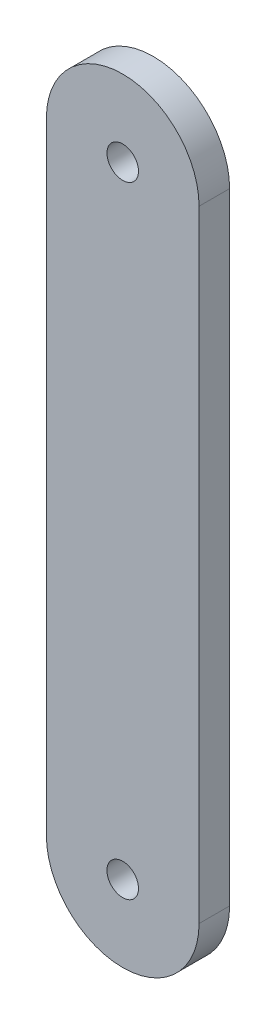
ISO-10303-21;
HEADER;
FILE_DESCRIPTION(('STEP AP214'),'2;1');
FILE_NAME('part.step','',(''),(''),'','','');
FILE_SCHEMA(('AUTOMOTIVE_DESIGN { 1 0 10303 214 1 1 1 1 }'));
ENDSEC;
DATA;
#1=APPLICATION_CONTEXT('core data for automotive mechanical design processes');
#2=APPLICATION_PROTOCOL_DEFINITION('international standard','automotive_design',2000,#1);
#3=PRODUCT_CONTEXT('',#1,'mechanical');
#4=PRODUCT('Part','Part','',(#3));
#5=PRODUCT_RELATED_PRODUCT_CATEGORY('part','',(#4));
#6=PRODUCT_DEFINITION_FORMATION('','',#4);
#7=PRODUCT_DEFINITION_CONTEXT('part definition',#1,'design');
#8=PRODUCT_DEFINITION('design','',#6,#7);
#9=PRODUCT_DEFINITION_SHAPE('','',#8);
#10=(LENGTH_UNIT() NAMED_UNIT(*) SI_UNIT(.MILLI.,.METRE.));
#11=(NAMED_UNIT(*) PLANE_ANGLE_UNIT() SI_UNIT($,.RADIAN.));
#12=(NAMED_UNIT(*) SI_UNIT($,.STERADIAN.) SOLID_ANGLE_UNIT());
#13=UNCERTAINTY_MEASURE_WITH_UNIT(LENGTH_MEASURE(1.E-05),#10,'distance_accuracy_value','');
#14=(GEOMETRIC_REPRESENTATION_CONTEXT(3) GLOBAL_UNCERTAINTY_ASSIGNED_CONTEXT((#13)) GLOBAL_UNIT_ASSIGNED_CONTEXT((#10,
#11,#12)) REPRESENTATION_CONTEXT('',''));
#15=CARTESIAN_POINT('',(0.,0.,0.));
#16=DIRECTION('',(0.,0.,1.));
#17=DIRECTION('',(1.,0.,0.));
#18=AXIS2_PLACEMENT_3D('',#15,#16,#17);
#19=CARTESIAN_POINT('',(0.,0.,3.));
#20=DIRECTION('',(0.,0.,1.));
#21=DIRECTION('',(1.,0.,0.));
#22=AXIS2_PLACEMENT_3D('',#19,#20,#21);
#23=PLANE('',#22);
#24=CARTESIAN_POINT('',(0.,0.,3.));
#25=DIRECTION('',(0.,0.,1.));
#26=DIRECTION('',(1.,0.,0.));
#27=AXIS2_PLACEMENT_3D('',#24,#25,#26);
#28=CIRCLE('',#27,1.55);
#29=CARTESIAN_POINT('',(1.55,0.,3.));
#30=VERTEX_POINT('',#29);
#31=EDGE_CURVE('E99',#30,#30,#28,.T.);
#32=ORIENTED_EDGE('',*,*,#31,.F.);
#33=EDGE_LOOP('',(#32));
#34=FACE_BOUND('',#33,.T.);
#35=CARTESIAN_POINT('',(0.,0.,3.));
#36=DIRECTION('',(0.,0.,1.));
#37=DIRECTION('',(1.,0.,0.));
#38=AXIS2_PLACEMENT_3D('',#35,#36,#37);
#39=CIRCLE('',#38,7.5);
#40=CARTESIAN_POINT('',(-7.5,0.,3.));
#41=VERTEX_POINT('',#40);
#42=CARTESIAN_POINT('',(7.5,0.,3.));
#43=VERTEX_POINT('',#42);
#44=EDGE_CURVE('E84',#41,#43,#39,.T.);
#45=ORIENTED_EDGE('',*,*,#44,.T.);
#46=DIRECTION('',(0.,1.,0.));
#47=VECTOR('',#46,1.);
#48=CARTESIAN_POINT('',(7.5,0.,3.));
#49=LINE('',#48,#47);
#50=CARTESIAN_POINT('',(7.49999999999999,61.03,3.));
#51=VERTEX_POINT('',#50);
#52=EDGE_CURVE('E79',#43,#51,#49,.T.);
#53=ORIENTED_EDGE('',*,*,#52,.T.);
#54=CARTESIAN_POINT('',(0.,61.03,3.));
#55=DIRECTION('',(0.,0.,1.));
#56=DIRECTION('',(1.,0.,0.));
#57=AXIS2_PLACEMENT_3D('',#54,#55,#56);
#58=CIRCLE('',#57,7.5);
#59=CARTESIAN_POINT('',(-7.50000000000001,61.03,3.));
#60=VERTEX_POINT('',#59);
#61=EDGE_CURVE('E82',#51,#60,#58,.T.);
#62=ORIENTED_EDGE('',*,*,#61,.T.);
#63=DIRECTION('',(0.,-1.,0.));
#64=VECTOR('',#63,1.);
#65=CARTESIAN_POINT('',(-7.5,0.,3.));
#66=LINE('',#65,#64);
#67=EDGE_CURVE('E49',#60,#41,#66,.T.);
#68=ORIENTED_EDGE('',*,*,#67,.T.);
#69=EDGE_LOOP('',(#45,#53,#62,#68));
#70=FACE_BOUND('',#69,.T.);
#71=CARTESIAN_POINT('',(0.,61.03,3.));
#72=DIRECTION('',(0.,0.,1.));
#73=DIRECTION('',(1.,0.,0.));
#74=AXIS2_PLACEMENT_3D('',#71,#72,#73);
#75=CIRCLE('',#74,1.55);
#76=CARTESIAN_POINT('',(1.55,61.03,3.));
#77=VERTEX_POINT('',#76);
#78=EDGE_CURVE('E114',#77,#77,#75,.T.);
#79=ORIENTED_EDGE('',*,*,#78,.F.);
#80=EDGE_LOOP('',(#79));
#81=FACE_BOUND('',#80,.T.);
#82=ADVANCED_FACE('F32',(#34,#70,#81),#23,.T.);
#83=CARTESIAN_POINT('',(0.,0.,0.));
#84=DIRECTION('',(0.,0.,1.));
#85=DIRECTION('',(1.,0.,0.));
#86=AXIS2_PLACEMENT_3D('',#83,#84,#85);
#87=PLANE('',#86);
#88=CARTESIAN_POINT('',(0.,0.,0.));
#89=DIRECTION('',(0.,0.,1.));
#90=DIRECTION('',(1.,0.,0.));
#91=AXIS2_PLACEMENT_3D('',#88,#89,#90);
#92=CIRCLE('',#91,7.5);
#93=CARTESIAN_POINT('',(-7.5,0.,0.));
#94=VERTEX_POINT('',#93);
#95=CARTESIAN_POINT('',(7.5,0.,0.));
#96=VERTEX_POINT('',#95);
#97=EDGE_CURVE('E96',#94,#96,#92,.T.);
#98=ORIENTED_EDGE('',*,*,#97,.F.);
#99=DIRECTION('',(0.,-1.,0.));
#100=VECTOR('',#99,1.);
#101=CARTESIAN_POINT('',(-7.5,0.,0.));
#102=LINE('',#101,#100);
#103=CARTESIAN_POINT('',(-7.50000000000001,61.03,0.));
#104=VERTEX_POINT('',#103);
#105=EDGE_CURVE('E72',#104,#94,#102,.T.);
#106=ORIENTED_EDGE('',*,*,#105,.F.);
#107=CARTESIAN_POINT('',(0.,61.03,0.));
#108=DIRECTION('',(0.,0.,1.));
#109=DIRECTION('',(1.,0.,0.));
#110=AXIS2_PLACEMENT_3D('',#107,#108,#109);
#111=CIRCLE('',#110,7.5);
#112=CARTESIAN_POINT('',(7.49999999999999,61.03,0.));
#113=VERTEX_POINT('',#112);
#114=EDGE_CURVE('E66',#113,#104,#111,.T.);
#115=ORIENTED_EDGE('',*,*,#114,.F.);
#116=DIRECTION('',(0.,1.,0.));
#117=VECTOR('',#116,1.);
#118=CARTESIAN_POINT('',(7.5,0.,0.));
#119=LINE('',#118,#117);
#120=EDGE_CURVE('E88',#96,#113,#119,.T.);
#121=ORIENTED_EDGE('',*,*,#120,.F.);
#122=EDGE_LOOP('',(#98,#106,#115,#121));
#123=FACE_BOUND('',#122,.T.);
#124=CARTESIAN_POINT('',(0.,0.,0.));
#125=DIRECTION('',(0.,0.,1.));
#126=DIRECTION('',(1.,0.,0.));
#127=AXIS2_PLACEMENT_3D('',#124,#125,#126);
#128=CIRCLE('',#127,1.55);
#129=CARTESIAN_POINT('',(1.55,0.,0.));
#130=VERTEX_POINT('',#129);
#131=EDGE_CURVE('E111',#130,#130,#128,.T.);
#132=ORIENTED_EDGE('',*,*,#131,.T.);
#133=EDGE_LOOP('',(#132));
#134=FACE_BOUND('',#133,.T.);
#135=CARTESIAN_POINT('',(0.,61.03,0.));
#136=DIRECTION('',(0.,0.,1.));
#137=DIRECTION('',(1.,0.,0.));
#138=AXIS2_PLACEMENT_3D('',#135,#136,#137);
#139=CIRCLE('',#138,1.55);
#140=CARTESIAN_POINT('',(1.55,61.03,0.));
#141=VERTEX_POINT('',#140);
#142=EDGE_CURVE('E117',#141,#141,#139,.T.);
#143=ORIENTED_EDGE('',*,*,#142,.T.);
#144=EDGE_LOOP('',(#143));
#145=FACE_BOUND('',#144,.T.);
#146=ADVANCED_FACE('F107',(#123,#134,#145),#87,.F.);
#147=CARTESIAN_POINT('',(0.,0.,3.));
#148=DIRECTION('',(0.,0.,-1.));
#149=DIRECTION('',(-1.,0.,0.));
#150=AXIS2_PLACEMENT_3D('',#147,#148,#149);
#151=CYLINDRICAL_SURFACE('',#150,7.5);
#152=ORIENTED_EDGE('',*,*,#97,.T.);
#153=DIRECTION('',(0.,0.,-1.));
#154=VECTOR('',#153,1.);
#155=CARTESIAN_POINT('',(7.5,0.,3.));
#156=LINE('',#155,#154);
#157=EDGE_CURVE('E11',#43,#96,#156,.T.);
#158=ORIENTED_EDGE('',*,*,#157,.F.);
#159=ORIENTED_EDGE('',*,*,#44,.F.);
#160=DIRECTION('',(0.,0.,-1.));
#161=VECTOR('',#160,1.);
#162=CARTESIAN_POINT('',(-7.5,0.,3.));
#163=LINE('',#162,#161);
#164=EDGE_CURVE('E92',#41,#94,#163,.T.);
#165=ORIENTED_EDGE('',*,*,#164,.T.);
#166=EDGE_LOOP('',(#152,#158,#159,#165));
#167=FACE_BOUND('',#166,.T.);
#168=ADVANCED_FACE('F34',(#167),#151,.T.);
#169=CARTESIAN_POINT('',(7.5,0.,3.));
#170=DIRECTION('',(-1.,0.,0.));
#171=DIRECTION('',(0.,-1.,0.));
#172=AXIS2_PLACEMENT_3D('',#169,#170,#171);
#173=PLANE('',#172);
#174=ORIENTED_EDGE('',*,*,#120,.T.);
#175=DIRECTION('',(0.,0.,-1.));
#176=VECTOR('',#175,1.);
#177=CARTESIAN_POINT('',(7.49999999999999,61.03,3.));
#178=LINE('',#177,#176);
#179=EDGE_CURVE('E41',#51,#113,#178,.T.);
#180=ORIENTED_EDGE('',*,*,#179,.F.);
#181=ORIENTED_EDGE('',*,*,#52,.F.);
#182=ORIENTED_EDGE('',*,*,#157,.T.);
#183=EDGE_LOOP('',(#174,#180,#181,#182));
#184=FACE_BOUND('',#183,.T.);
#185=ADVANCED_FACE('F87',(#184),#173,.F.);
#186=CARTESIAN_POINT('',(0.,61.03,3.));
#187=DIRECTION('',(0.,0.,-1.));
#188=DIRECTION('',(-1.,0.,0.));
#189=AXIS2_PLACEMENT_3D('',#186,#187,#188);
#190=CYLINDRICAL_SURFACE('',#189,7.5);
#191=ORIENTED_EDGE('',*,*,#114,.T.);
#192=DIRECTION('',(0.,0.,-1.));
#193=VECTOR('',#192,1.);
#194=CARTESIAN_POINT('',(-7.50000000000001,61.03,3.));
#195=LINE('',#194,#193);
#196=EDGE_CURVE('E89',#60,#104,#195,.T.);
#197=ORIENTED_EDGE('',*,*,#196,.F.);
#198=ORIENTED_EDGE('',*,*,#61,.F.);
#199=ORIENTED_EDGE('',*,*,#179,.T.);
#200=EDGE_LOOP('',(#191,#197,#198,#199));
#201=FACE_BOUND('',#200,.T.);
#202=ADVANCED_FACE('F90',(#201),#190,.T.);
#203=CARTESIAN_POINT('',(-7.5,0.,3.));
#204=DIRECTION('',(1.,0.,0.));
#205=DIRECTION('',(0.,1.,0.));
#206=AXIS2_PLACEMENT_3D('',#203,#204,#205);
#207=PLANE('',#206);
#208=ORIENTED_EDGE('',*,*,#105,.T.);
#209=ORIENTED_EDGE('',*,*,#164,.F.);
#210=ORIENTED_EDGE('',*,*,#67,.F.);
#211=ORIENTED_EDGE('',*,*,#196,.T.);
#212=EDGE_LOOP('',(#208,#209,#210,#211));
#213=FACE_BOUND('',#212,.T.);
#214=ADVANCED_FACE('F104',(#213),#207,.F.);
#215=CARTESIAN_POINT('',(0.,0.,3.));
#216=DIRECTION('',(0.,0.,-1.));
#217=DIRECTION('',(-1.,0.,0.));
#218=AXIS2_PLACEMENT_3D('',#215,#216,#217);
#219=CYLINDRICAL_SURFACE('',#218,1.55);
#220=ORIENTED_EDGE('',*,*,#31,.T.);
#221=EDGE_LOOP('',(#220));
#222=FACE_BOUND('',#221,.T.);
#223=ORIENTED_EDGE('',*,*,#131,.F.);
#224=EDGE_LOOP('',(#223));
#225=FACE_BOUND('',#224,.T.);
#226=ADVANCED_FACE('F134',(#222,#225),#219,.F.);
#227=CARTESIAN_POINT('',(0.,61.03,3.));
#228=DIRECTION('',(0.,0.,-1.));
#229=DIRECTION('',(-1.,0.,0.));
#230=AXIS2_PLACEMENT_3D('',#227,#228,#229);
#231=CYLINDRICAL_SURFACE('',#230,1.55);
#232=ORIENTED_EDGE('',*,*,#78,.T.);
#233=EDGE_LOOP('',(#232));
#234=FACE_BOUND('',#233,.T.);
#235=ORIENTED_EDGE('',*,*,#142,.F.);
#236=EDGE_LOOP('',(#235));
#237=FACE_BOUND('',#236,.T.);
#238=ADVANCED_FACE('F123',(#234,#237),#231,.F.);
#239=CLOSED_SHELL('',(#82,#146,#168,#185,#202,#214,#226,#238));
#240=MANIFOLD_SOLID_BREP('B2',#239);
#241=ADVANCED_BREP_SHAPE_REPRESENTATION('',(#18,#240),#14);
#242=SHAPE_DEFINITION_REPRESENTATION(#9,#241);
ENDSEC;
END-ISO-10303-21;
